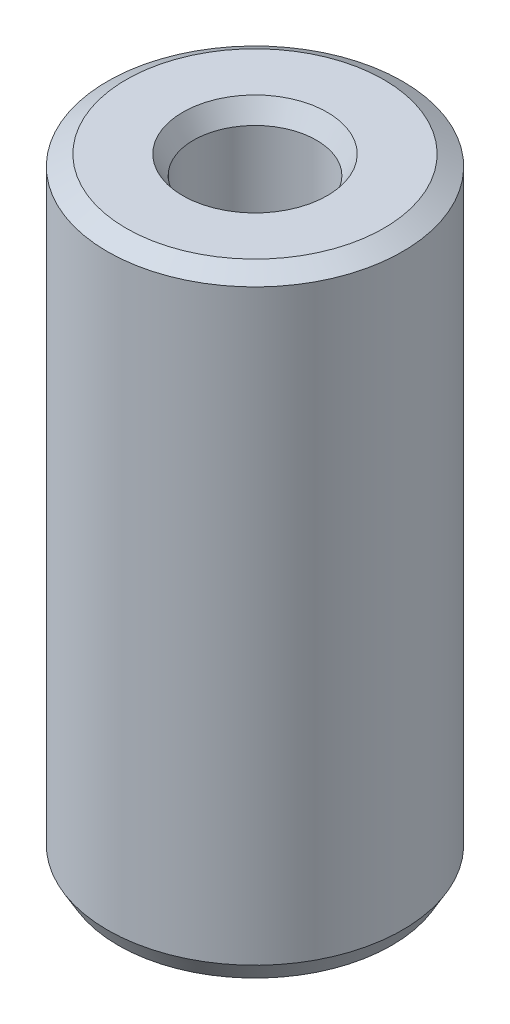
ISO-10303-21;
HEADER;
FILE_DESCRIPTION(('STEP AP214'),'2;1');
FILE_NAME('part.step','',(''),(''),'','','');
FILE_SCHEMA(('AUTOMOTIVE_DESIGN { 1 0 10303 214 1 1 1 1 }'));
ENDSEC;
DATA;
#1=APPLICATION_CONTEXT('core data for automotive mechanical design processes');
#2=APPLICATION_PROTOCOL_DEFINITION('international standard','automotive_design',2000,#1);
#3=PRODUCT_CONTEXT('',#1,'mechanical');
#4=PRODUCT('Part','Part','',(#3));
#5=PRODUCT_RELATED_PRODUCT_CATEGORY('part','',(#4));
#6=PRODUCT_DEFINITION_FORMATION('','',#4);
#7=PRODUCT_DEFINITION_CONTEXT('part definition',#1,'design');
#8=PRODUCT_DEFINITION('design','',#6,#7);
#9=PRODUCT_DEFINITION_SHAPE('','',#8);
#10=(LENGTH_UNIT() NAMED_UNIT(*) SI_UNIT(.MILLI.,.METRE.));
#11=(NAMED_UNIT(*) PLANE_ANGLE_UNIT() SI_UNIT($,.RADIAN.));
#12=(NAMED_UNIT(*) SI_UNIT($,.STERADIAN.) SOLID_ANGLE_UNIT());
#13=UNCERTAINTY_MEASURE_WITH_UNIT(LENGTH_MEASURE(1.E-05),#10,'distance_accuracy_value','');
#14=(GEOMETRIC_REPRESENTATION_CONTEXT(3) GLOBAL_UNCERTAINTY_ASSIGNED_CONTEXT((#13)) GLOBAL_UNIT_ASSIGNED_CONTEXT((#10,
#11,#12)) REPRESENTATION_CONTEXT('',''));
#15=CARTESIAN_POINT('',(0.,0.,0.));
#16=DIRECTION('',(0.,0.,1.));
#17=DIRECTION('',(1.,0.,0.));
#18=AXIS2_PLACEMENT_3D('',#15,#16,#17);
#19=CARTESIAN_POINT('',(0.,146.353367313672,0.));
#20=DIRECTION('',(0.,-1.,0.));
#21=DIRECTION('',(0.,0.,-1.));
#22=AXIS2_PLACEMENT_3D('',#19,#20,#21);
#23=CYLINDRICAL_SURFACE('',#22,35.);
#24=CARTESIAN_POINT('',(0.,4.45017378828236,0.));
#25=DIRECTION('',(0.,1.,0.));
#26=DIRECTION('',(0.,0.,1.));
#27=AXIS2_PLACEMENT_3D('',#24,#25,#26);
#28=CIRCLE('',#27,35.);
#29=CARTESIAN_POINT('',(0.,4.45017378828236,35.));
#30=VERTEX_POINT('',#29);
#31=EDGE_CURVE('E10',#30,#30,#28,.T.);
#32=ORIENTED_EDGE('',*,*,#31,.T.);
#33=EDGE_LOOP('',(#32));
#34=FACE_BOUND('',#33,.T.);
#35=CARTESIAN_POINT('',(0.,143.784058279066,0.));
#36=DIRECTION('',(0.,1.,0.));
#37=DIRECTION('',(0.,0.,1.));
#38=AXIS2_PLACEMENT_3D('',#35,#36,#37);
#39=CIRCLE('',#38,35.);
#40=CARTESIAN_POINT('',(0.,143.784058279066,35.));
#41=VERTEX_POINT('',#40);
#42=EDGE_CURVE('E50',#41,#41,#39,.F.);
#43=ORIENTED_EDGE('',*,*,#42,.T.);
#44=EDGE_LOOP('',(#43));
#45=FACE_BOUND('',#44,.T.);
#46=ADVANCED_FACE('F39',(#34,#45),#23,.T.);
#47=CARTESIAN_POINT('',(0.,146.353367313672,0.));
#48=DIRECTION('',(0.,1.,0.));
#49=DIRECTION('',(0.,0.,1.));
#50=AXIS2_PLACEMENT_3D('',#47,#48,#49);
#51=PLANE('',#50);
#52=CARTESIAN_POINT('',(0.,146.353367313672,0.));
#53=DIRECTION('',(0.,1.,0.));
#54=DIRECTION('',(0.,0.,1.));
#55=AXIS2_PLACEMENT_3D('',#52,#53,#54);
#56=CIRCLE('',#55,17.1486688728552);
#57=CARTESIAN_POINT('',(0.,146.353367313672,17.1486688728552));
#58=VERTEX_POINT('',#57);
#59=EDGE_CURVE('E58',#58,#58,#56,.F.);
#60=ORIENTED_EDGE('',*,*,#59,.T.);
#61=EDGE_LOOP('',(#60));
#62=FACE_BOUND('',#61,.T.);
#63=CARTESIAN_POINT('',(0.,146.353367313672,0.));
#64=DIRECTION('',(0.,1.,0.));
#65=DIRECTION('',(0.,0.,1.));
#66=AXIS2_PLACEMENT_3D('',#63,#64,#65);
#67=CIRCLE('',#66,30.5498262117177);
#68=CARTESIAN_POINT('',(0.,146.353367313672,30.5498262117177));
#69=VERTEX_POINT('',#68);
#70=EDGE_CURVE('E61',#69,#69,#67,.T.);
#71=ORIENTED_EDGE('',*,*,#70,.T.);
#72=EDGE_LOOP('',(#71));
#73=FACE_BOUND('',#72,.T.);
#74=ADVANCED_FACE('F88',(#62,#73),#51,.T.);
#75=CARTESIAN_POINT('',(0.,0.,0.));
#76=DIRECTION('',(0.,1.,0.));
#77=DIRECTION('',(0.,0.,1.));
#78=AXIS2_PLACEMENT_3D('',#75,#76,#77);
#79=PLANE('',#78);
#80=CARTESIAN_POINT('',(0.,0.,0.));
#81=DIRECTION('',(0.,1.,0.));
#82=DIRECTION('',(0.,0.,1.));
#83=AXIS2_PLACEMENT_3D('',#80,#81,#82);
#84=CIRCLE('',#83,19.029533626532);
#85=CARTESIAN_POINT('',(0.,0.,19.029533626532));
#86=VERTEX_POINT('',#85);
#87=EDGE_CURVE('E51',#86,#86,#84,.T.);
#88=ORIENTED_EDGE('',*,*,#87,.T.);
#89=EDGE_LOOP('',(#88));
#90=FACE_BOUND('',#89,.T.);
#91=CARTESIAN_POINT('',(0.,0.,0.));
#92=DIRECTION('',(0.,1.,0.));
#93=DIRECTION('',(0.,0.,1.));
#94=AXIS2_PLACEMENT_3D('',#91,#92,#93);
#95=CIRCLE('',#94,32.4306909653946);
#96=CARTESIAN_POINT('',(0.,0.,32.4306909653946));
#97=VERTEX_POINT('',#96);
#98=EDGE_CURVE('E54',#97,#97,#95,.F.);
#99=ORIENTED_EDGE('',*,*,#98,.T.);
#100=EDGE_LOOP('',(#99));
#101=FACE_BOUND('',#100,.T.);
#102=ADVANCED_FACE('F83',(#90,#101),#79,.F.);
#103=CARTESIAN_POINT('',(0.,146.353367313672,0.));
#104=DIRECTION('',(0.,-1.,0.));
#105=DIRECTION('',(0.,0.,-1.));
#106=AXIS2_PLACEMENT_3D('',#103,#104,#105);
#107=CYLINDRICAL_SURFACE('',#106,14.5793598382497);
#108=CARTESIAN_POINT('',(0.,141.903193525389,0.));
#109=DIRECTION('',(0.,1.,0.));
#110=DIRECTION('',(0.,0.,1.));
#111=AXIS2_PLACEMENT_3D('',#108,#109,#110);
#112=CIRCLE('',#111,14.5793598382497);
#113=CARTESIAN_POINT('',(0.,141.903193525389,14.5793598382497));
#114=VERTEX_POINT('',#113);
#115=EDGE_CURVE('E67',#114,#114,#112,.T.);
#116=ORIENTED_EDGE('',*,*,#115,.T.);
#117=EDGE_LOOP('',(#116));
#118=FACE_BOUND('',#117,.T.);
#119=CARTESIAN_POINT('',(0.,2.56930903460542,0.));
#120=DIRECTION('',(0.,1.,0.));
#121=DIRECTION('',(0.,0.,1.));
#122=AXIS2_PLACEMENT_3D('',#119,#120,#121);
#123=CIRCLE('',#122,14.5793598382497);
#124=CARTESIAN_POINT('',(0.,2.56930903460542,14.5793598382497));
#125=VERTEX_POINT('',#124);
#126=EDGE_CURVE('E69',#125,#125,#123,.F.);
#127=ORIENTED_EDGE('',*,*,#126,.T.);
#128=EDGE_LOOP('',(#127));
#129=FACE_BOUND('',#128,.T.);
#130=ADVANCED_FACE('F71',(#118,#129),#107,.F.);
#131=CARTESIAN_POINT('',(0.,141.903193525389,0.));
#132=DIRECTION('',(0.,1.,0.));
#133=DIRECTION('',(0.,0.,1.));
#134=AXIS2_PLACEMENT_3D('',#131,#132,#133);
#135=CONICAL_SURFACE('',#134,14.5793598382497,0.523598775598301);
#136=ORIENTED_EDGE('',*,*,#59,.F.);
#137=EDGE_LOOP('',(#136));
#138=FACE_BOUND('',#137,.T.);
#139=ORIENTED_EDGE('',*,*,#115,.F.);
#140=EDGE_LOOP('',(#139));
#141=FACE_BOUND('',#140,.T.);
#142=ADVANCED_FACE('F77',(#138,#141),#135,.F.);
#143=CARTESIAN_POINT('',(0.,0.,0.));
#144=DIRECTION('',(0.,-1.,0.));
#145=DIRECTION('',(0.,0.,-1.));
#146=AXIS2_PLACEMENT_3D('',#143,#144,#145);
#147=CONICAL_SURFACE('',#146,19.029533626532,1.0471975511966);
#148=ORIENTED_EDGE('',*,*,#126,.F.);
#149=EDGE_LOOP('',(#148));
#150=FACE_BOUND('',#149,.T.);
#151=ORIENTED_EDGE('',*,*,#87,.F.);
#152=EDGE_LOOP('',(#151));
#153=FACE_BOUND('',#152,.T.);
#154=ADVANCED_FACE('F73',(#150,#153),#147,.F.);
#155=CARTESIAN_POINT('',(0.,4.45017378828236,0.));
#156=DIRECTION('',(0.,1.,0.));
#157=DIRECTION('',(0.,0.,1.));
#158=AXIS2_PLACEMENT_3D('',#155,#156,#157);
#159=CONICAL_SURFACE('',#158,35.,0.5235987755983);
#160=ORIENTED_EDGE('',*,*,#98,.F.);
#161=EDGE_LOOP('',(#160));
#162=FACE_BOUND('',#161,.T.);
#163=ORIENTED_EDGE('',*,*,#31,.F.);
#164=EDGE_LOOP('',(#163));
#165=FACE_BOUND('',#164,.T.);
#166=ADVANCED_FACE('F76',(#162,#165),#159,.T.);
#167=CARTESIAN_POINT('',(0.,146.353367313672,0.));
#168=DIRECTION('',(0.,-1.,0.));
#169=DIRECTION('',(0.,0.,-1.));
#170=AXIS2_PLACEMENT_3D('',#167,#168,#169);
#171=CONICAL_SURFACE('',#170,30.5498262117177,1.0471975511966);
#172=ORIENTED_EDGE('',*,*,#42,.F.);
#173=EDGE_LOOP('',(#172));
#174=FACE_BOUND('',#173,.T.);
#175=ORIENTED_EDGE('',*,*,#70,.F.);
#176=EDGE_LOOP('',(#175));
#177=FACE_BOUND('',#176,.T.);
#178=ADVANCED_FACE('F45',(#174,#177),#171,.T.);
#179=CLOSED_SHELL('',(#46,#74,#102,#130,#142,#154,#166,#178));
#180=MANIFOLD_SOLID_BREP('B2',#179);
#181=ADVANCED_BREP_SHAPE_REPRESENTATION('',(#18,#180),#14);
#182=SHAPE_DEFINITION_REPRESENTATION(#9,#181);
ENDSEC;
END-ISO-10303-21;
